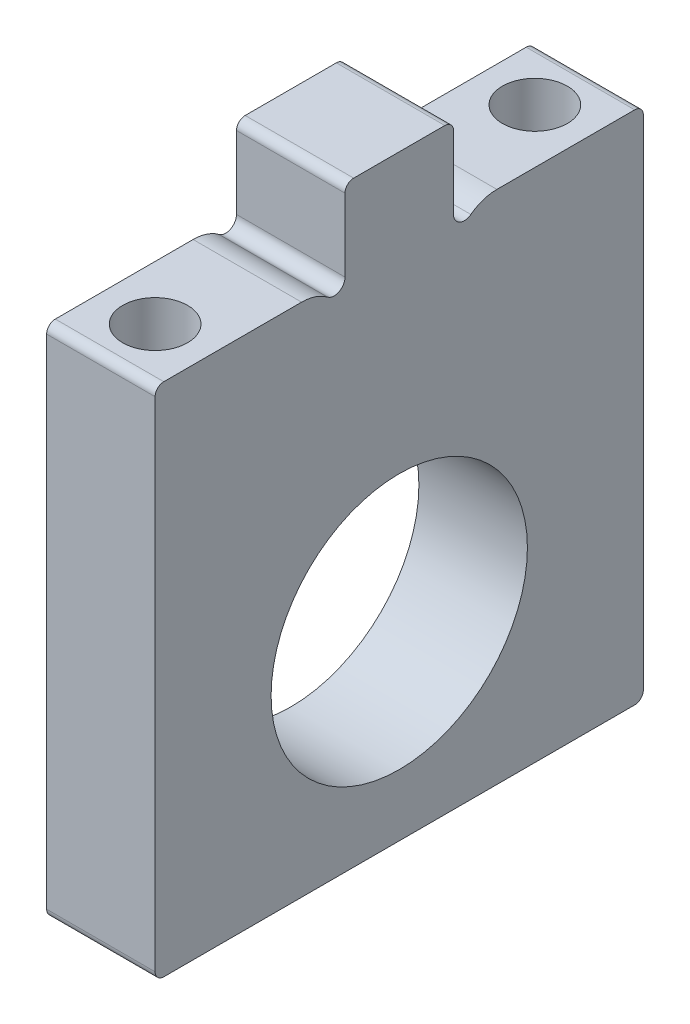
ISO-10303-21;
HEADER;
FILE_DESCRIPTION(('STEP AP214'),'2;1');
FILE_NAME('part.step','',(''),(''),'','','');
FILE_SCHEMA(('AUTOMOTIVE_DESIGN { 1 0 10303 214 1 1 1 1 }'));
ENDSEC;
DATA;
#1=APPLICATION_CONTEXT('core data for automotive mechanical design processes');
#2=APPLICATION_PROTOCOL_DEFINITION('international standard','automotive_design',2000,#1);
#3=PRODUCT_CONTEXT('',#1,'mechanical');
#4=PRODUCT('Part','Part','',(#3));
#5=PRODUCT_RELATED_PRODUCT_CATEGORY('part','',(#4));
#6=PRODUCT_DEFINITION_FORMATION('','',#4);
#7=PRODUCT_DEFINITION_CONTEXT('part definition',#1,'design');
#8=PRODUCT_DEFINITION('design','',#6,#7);
#9=PRODUCT_DEFINITION_SHAPE('','',#8);
#10=(LENGTH_UNIT() NAMED_UNIT(*) SI_UNIT(.MILLI.,.METRE.));
#11=(NAMED_UNIT(*) PLANE_ANGLE_UNIT() SI_UNIT($,.RADIAN.));
#12=(NAMED_UNIT(*) SI_UNIT($,.STERADIAN.) SOLID_ANGLE_UNIT());
#13=UNCERTAINTY_MEASURE_WITH_UNIT(LENGTH_MEASURE(1.E-05),#10,'distance_accuracy_value','');
#14=(GEOMETRIC_REPRESENTATION_CONTEXT(3) GLOBAL_UNCERTAINTY_ASSIGNED_CONTEXT((#13)) GLOBAL_UNIT_ASSIGNED_CONTEXT((#10,
#11,#12)) REPRESENTATION_CONTEXT('',''));
#15=CARTESIAN_POINT('',(0.,0.,0.));
#16=DIRECTION('',(0.,0.,1.));
#17=DIRECTION('',(1.,0.,0.));
#18=AXIS2_PLACEMENT_3D('',#15,#16,#17);
#19=CARTESIAN_POINT('',(0.,19.05,0.));
#20=DIRECTION('',(0.,-1.,0.));
#21=DIRECTION('',(0.,0.,-1.));
#22=AXIS2_PLACEMENT_3D('',#19,#20,#21);
#23=PLANE('',#22);
#24=CARTESIAN_POINT('',(30.1625,19.05,11.1125));
#25=DIRECTION('',(0.,1.,0.));
#26=DIRECTION('',(0.,0.,1.));
#27=AXIS2_PLACEMENT_3D('',#24,#25,#26);
#28=CIRCLE('',#27,1.89865);
#29=CARTESIAN_POINT('',(30.1625,19.05,13.01115));
#30=VERTEX_POINT('',#29);
#31=EDGE_CURVE('E312',#30,#30,#28,.F.);
#32=ORIENTED_EDGE('',*,*,#31,.T.);
#33=EDGE_LOOP('',(#32));
#34=FACE_BOUND('',#33,.T.);
#35=DIRECTION('',(0.,0.,-1.));
#36=VECTOR('',#35,1.);
#37=CARTESIAN_POINT('',(26.9875,19.05,-12.7));
#38=LINE('',#37,#36);
#39=CARTESIAN_POINT('',(26.9875,19.05,13.7795));
#40=VERTEX_POINT('',#39);
#41=CARTESIAN_POINT('',(26.9875,19.05,5.715));
#42=VERTEX_POINT('',#41);
#43=EDGE_CURVE('E214',#40,#42,#38,.T.);
#44=ORIENTED_EDGE('',*,*,#43,.F.);
#45=DIRECTION('',(1.,0.,0.));
#46=VECTOR('',#45,1.);
#47=CARTESIAN_POINT('',(33.3375,19.05,13.7795));
#48=LINE('',#47,#46);
#49=CARTESIAN_POINT('',(33.3375,19.05,13.7795));
#50=VERTEX_POINT('',#49);
#51=EDGE_CURVE('E42',#40,#50,#48,.T.);
#52=ORIENTED_EDGE('',*,*,#51,.T.);
#53=DIRECTION('',(0.,0.,1.));
#54=VECTOR('',#53,1.);
#55=CARTESIAN_POINT('',(33.3375,19.05,-12.7));
#56=LINE('',#55,#54);
#57=CARTESIAN_POINT('',(33.3375,19.05,5.715));
#58=VERTEX_POINT('',#57);
#59=EDGE_CURVE('E216',#58,#50,#56,.T.);
#60=ORIENTED_EDGE('',*,*,#59,.F.);
#61=DIRECTION('',(-1.,0.,0.));
#62=VECTOR('',#61,1.);
#63=CARTESIAN_POINT('',(0.,19.05,5.715));
#64=LINE('',#63,#62);
#65=EDGE_CURVE('E213',#58,#42,#64,.T.);
#66=ORIENTED_EDGE('',*,*,#65,.T.);
#67=EDGE_LOOP('',(#44,#52,#60,#66));
#68=FACE_BOUND('',#67,.T.);
#69=ADVANCED_FACE('F34',(#34,#68),#23,.F.);
#70=CARTESIAN_POINT('',(26.9875,-11.1125,-12.7));
#71=DIRECTION('',(1.,0.,0.));
#72=DIRECTION('',(0.,0.,-1.));
#73=AXIS2_PLACEMENT_3D('',#70,#71,#72);
#74=PLANE('',#73);
#75=CARTESIAN_POINT('',(26.9875,0.,0.));
#76=DIRECTION('',(1.,0.,0.));
#77=DIRECTION('',(0.,0.,-1.));
#78=AXIS2_PLACEMENT_3D('',#75,#76,#77);
#79=CIRCLE('',#78,7.5);
#80=CARTESIAN_POINT('',(26.9875,0.,-7.5));
#81=VERTEX_POINT('',#80);
#82=EDGE_CURVE('E188',#81,#81,#79,.F.);
#83=ORIENTED_EDGE('',*,*,#82,.F.);
#84=EDGE_LOOP('',(#83));
#85=FACE_BOUND('',#84,.T.);
#86=DIRECTION('',(0.,-1.,0.));
#87=VECTOR('',#86,1.);
#88=CARTESIAN_POINT('',(26.9875,19.05,-14.2875));
#89=LINE('',#88,#87);
#90=CARTESIAN_POINT('',(26.9875,18.542,-14.2875));
#91=VERTEX_POINT('',#90);
#92=CARTESIAN_POINT('',(26.9875,-10.6045,-14.2875));
#93=VERTEX_POINT('',#92);
#94=EDGE_CURVE('E321',#91,#93,#89,.T.);
#95=ORIENTED_EDGE('',*,*,#94,.T.);
#96=CARTESIAN_POINT('',(26.9875,-10.6045,-13.7795));
#97=DIRECTION('',(1.,0.,0.));
#98=DIRECTION('',(0.,0.,-1.));
#99=AXIS2_PLACEMENT_3D('',#96,#97,#98);
#100=CIRCLE('',#99,0.508);
#101=CARTESIAN_POINT('',(26.9875,-11.1125,-13.7795));
#102=VERTEX_POINT('',#101);
#103=EDGE_CURVE('E265',#93,#102,#100,.F.);
#104=ORIENTED_EDGE('',*,*,#103,.T.);
#105=DIRECTION('',(0.,0.,-1.));
#106=VECTOR('',#105,1.);
#107=CARTESIAN_POINT('',(26.9875,-11.1125,-12.7));
#108=LINE('',#107,#106);
#109=CARTESIAN_POINT('',(26.9875,-11.1125,13.7795));
#110=VERTEX_POINT('',#109);
#111=EDGE_CURVE('E206',#110,#102,#108,.T.);
#112=ORIENTED_EDGE('',*,*,#111,.F.);
#113=CARTESIAN_POINT('',(26.9875,-10.6045,13.7795));
#114=DIRECTION('',(1.,0.,0.));
#115=DIRECTION('',(0.,0.,-1.));
#116=AXIS2_PLACEMENT_3D('',#113,#114,#115);
#117=CIRCLE('',#116,0.508);
#118=CARTESIAN_POINT('',(26.9875,-10.6045,14.2875));
#119=VERTEX_POINT('',#118);
#120=EDGE_CURVE('E56',#110,#119,#117,.F.);
#121=ORIENTED_EDGE('',*,*,#120,.T.);
#122=DIRECTION('',(0.,1.,0.));
#123=VECTOR('',#122,1.);
#124=CARTESIAN_POINT('',(26.9875,19.05,14.2875));
#125=LINE('',#124,#123);
#126=CARTESIAN_POINT('',(26.9875,18.542,14.2875));
#127=VERTEX_POINT('',#126);
#128=EDGE_CURVE('E326',#119,#127,#125,.T.);
#129=ORIENTED_EDGE('',*,*,#128,.T.);
#130=CARTESIAN_POINT('',(26.9875,18.542,13.7795));
#131=DIRECTION('',(1.,0.,0.));
#132=DIRECTION('',(0.,0.,-1.));
#133=AXIS2_PLACEMENT_3D('',#130,#131,#132);
#134=CIRCLE('',#133,0.508);
#135=EDGE_CURVE('E258',#127,#40,#134,.F.);
#136=ORIENTED_EDGE('',*,*,#135,.T.);
#137=ORIENTED_EDGE('',*,*,#43,.T.);
#138=CARTESIAN_POINT('',(26.9875,16.51,5.715));
#139=DIRECTION('',(1.,0.,0.));
#140=DIRECTION('',(0.,0.,-1.));
#141=AXIS2_PLACEMENT_3D('',#138,#139,#140);
#142=CIRCLE('',#141,2.54);
#143=CARTESIAN_POINT('',(26.9875,18.542,4.191));
#144=VERTEX_POINT('',#143);
#145=EDGE_CURVE('E222',#42,#144,#142,.F.);
#146=ORIENTED_EDGE('',*,*,#145,.T.);
#147=CARTESIAN_POINT('',(26.9875,19.05,3.81));
#148=DIRECTION('',(-1.,0.,0.));
#149=DIRECTION('',(0.,0.,1.));
#150=AXIS2_PLACEMENT_3D('',#147,#148,#149);
#151=CIRCLE('',#150,0.635);
#152=CARTESIAN_POINT('',(26.9875,19.05,3.175));
#153=VERTEX_POINT('',#152);
#154=EDGE_CURVE('E301',#153,#144,#151,.T.);
#155=ORIENTED_EDGE('',*,*,#154,.F.);
#156=DIRECTION('',(0.,1.,0.));
#157=VECTOR('',#156,1.);
#158=CARTESIAN_POINT('',(26.9875,23.8125,3.175));
#159=LINE('',#158,#157);
#160=CARTESIAN_POINT('',(26.9875,23.3045,3.175));
#161=VERTEX_POINT('',#160);
#162=EDGE_CURVE('E196',#153,#161,#159,.T.);
#163=ORIENTED_EDGE('',*,*,#162,.T.);
#164=CARTESIAN_POINT('',(26.9875,23.3045,2.667));
#165=DIRECTION('',(1.,0.,0.));
#166=DIRECTION('',(0.,0.,-1.));
#167=AXIS2_PLACEMENT_3D('',#164,#165,#166);
#168=CIRCLE('',#167,0.508);
#169=CARTESIAN_POINT('',(26.9875,23.8125,2.667));
#170=VERTEX_POINT('',#169);
#171=EDGE_CURVE('E260',#161,#170,#168,.F.);
#172=ORIENTED_EDGE('',*,*,#171,.T.);
#173=DIRECTION('',(0.,0.,-1.));
#174=VECTOR('',#173,1.);
#175=CARTESIAN_POINT('',(26.9875,23.8125,-3.175));
#176=LINE('',#175,#174);
#177=CARTESIAN_POINT('',(26.9875,23.8125,-2.667));
#178=VERTEX_POINT('',#177);
#179=EDGE_CURVE('E201',#170,#178,#176,.T.);
#180=ORIENTED_EDGE('',*,*,#179,.T.);
#181=CARTESIAN_POINT('',(26.9875,23.3045,-2.667));
#182=DIRECTION('',(1.,0.,0.));
#183=DIRECTION('',(0.,0.,-1.));
#184=AXIS2_PLACEMENT_3D('',#181,#182,#183);
#185=CIRCLE('',#184,0.508);
#186=CARTESIAN_POINT('',(26.9875,23.3045,-3.175));
#187=VERTEX_POINT('',#186);
#188=EDGE_CURVE('E262',#178,#187,#185,.F.);
#189=ORIENTED_EDGE('',*,*,#188,.T.);
#190=DIRECTION('',(0.,-1.,0.));
#191=VECTOR('',#190,1.);
#192=CARTESIAN_POINT('',(26.9875,19.05,-3.175));
#193=LINE('',#192,#191);
#194=CARTESIAN_POINT('',(26.9875,19.05,-3.175));
#195=VERTEX_POINT('',#194);
#196=EDGE_CURVE('E203',#187,#195,#193,.T.);
#197=ORIENTED_EDGE('',*,*,#196,.T.);
#198=CARTESIAN_POINT('',(26.9875,19.05,-3.81));
#199=DIRECTION('',(-1.,0.,0.));
#200=DIRECTION('',(0.,0.,1.));
#201=AXIS2_PLACEMENT_3D('',#198,#199,#200);
#202=CIRCLE('',#201,0.635);
#203=CARTESIAN_POINT('',(26.9875,18.542,-4.191));
#204=VERTEX_POINT('',#203);
#205=EDGE_CURVE('E171',#204,#195,#202,.T.);
#206=ORIENTED_EDGE('',*,*,#205,.F.);
#207=CARTESIAN_POINT('',(26.9875,16.51,-5.715));
#208=DIRECTION('',(1.,0.,0.));
#209=DIRECTION('',(0.,0.,-1.));
#210=AXIS2_PLACEMENT_3D('',#207,#208,#209);
#211=CIRCLE('',#210,2.54);
#212=CARTESIAN_POINT('',(26.9875,19.05,-5.715));
#213=VERTEX_POINT('',#212);
#214=EDGE_CURVE('E220',#204,#213,#211,.F.);
#215=ORIENTED_EDGE('',*,*,#214,.T.);
#216=CARTESIAN_POINT('',(26.9875,19.05,-13.7795));
#217=VERTEX_POINT('',#216);
#218=EDGE_CURVE('E205',#213,#217,#38,.T.);
#219=ORIENTED_EDGE('',*,*,#218,.T.);
#220=CARTESIAN_POINT('',(26.9875,18.542,-13.7795));
#221=DIRECTION('',(1.,0.,0.));
#222=DIRECTION('',(0.,0.,-1.));
#223=AXIS2_PLACEMENT_3D('',#220,#221,#222);
#224=CIRCLE('',#223,0.508);
#225=EDGE_CURVE('E256',#217,#91,#224,.F.);
#226=ORIENTED_EDGE('',*,*,#225,.T.);
#227=EDGE_LOOP('',(#95,#104,#112,#121,#129,#136,#137,#146,#155,#163,#172,#180,#189,#197,#206,
#215,#219,#226));
#228=FACE_BOUND('',#227,.T.);
#229=ADVANCED_FACE('F299',(#85,#228),#74,.F.);
#230=CARTESIAN_POINT('',(33.3375,-11.1125,-12.7));
#231=DIRECTION('',(-1.,0.,0.));
#232=DIRECTION('',(0.,0.,1.));
#233=AXIS2_PLACEMENT_3D('',#230,#231,#232);
#234=PLANE('',#233);
#235=CARTESIAN_POINT('',(33.3375,0.,0.));
#236=DIRECTION('',(1.,0.,0.));
#237=DIRECTION('',(0.,0.,-1.));
#238=AXIS2_PLACEMENT_3D('',#235,#236,#237);
#239=CIRCLE('',#238,7.5);
#240=CARTESIAN_POINT('',(33.3375,0.,-7.5));
#241=VERTEX_POINT('',#240);
#242=EDGE_CURVE('E193',#241,#241,#239,.T.);
#243=ORIENTED_EDGE('',*,*,#242,.F.);
#244=EDGE_LOOP('',(#243));
#245=FACE_BOUND('',#244,.T.);
#246=DIRECTION('',(0.,0.,1.));
#247=VECTOR('',#246,1.);
#248=CARTESIAN_POINT('',(33.3375,-11.1125,-12.7));
#249=LINE('',#248,#247);
#250=CARTESIAN_POINT('',(33.3375,-11.1125,-13.7795));
#251=VERTEX_POINT('',#250);
#252=CARTESIAN_POINT('',(33.3375,-11.1125,13.7795));
#253=VERTEX_POINT('',#252);
#254=EDGE_CURVE('E209',#251,#253,#249,.T.);
#255=ORIENTED_EDGE('',*,*,#254,.F.);
#256=CARTESIAN_POINT('',(33.3375,-10.6045,-13.7795));
#257=DIRECTION('',(-1.,0.,0.));
#258=DIRECTION('',(0.,0.,1.));
#259=AXIS2_PLACEMENT_3D('',#256,#257,#258);
#260=CIRCLE('',#259,0.508);
#261=CARTESIAN_POINT('',(33.3375,-10.6045,-14.2875));
#262=VERTEX_POINT('',#261);
#263=EDGE_CURVE('E249',#251,#262,#260,.F.);
#264=ORIENTED_EDGE('',*,*,#263,.T.);
#265=DIRECTION('',(0.,1.,0.));
#266=VECTOR('',#265,1.);
#267=CARTESIAN_POINT('',(33.3375,19.05,-14.2875));
#268=LINE('',#267,#266);
#269=CARTESIAN_POINT('',(33.3375,18.542,-14.2875));
#270=VERTEX_POINT('',#269);
#271=EDGE_CURVE('E316',#262,#270,#268,.T.);
#272=ORIENTED_EDGE('',*,*,#271,.T.);
#273=CARTESIAN_POINT('',(33.3375,18.542,-13.7795));
#274=DIRECTION('',(-1.,0.,0.));
#275=DIRECTION('',(0.,0.,1.));
#276=AXIS2_PLACEMENT_3D('',#273,#274,#275);
#277=CIRCLE('',#276,0.508);
#278=CARTESIAN_POINT('',(33.3375,19.05,-13.7795));
#279=VERTEX_POINT('',#278);
#280=EDGE_CURVE('E239',#270,#279,#277,.F.);
#281=ORIENTED_EDGE('',*,*,#280,.T.);
#282=CARTESIAN_POINT('',(33.3375,19.05,-5.715));
#283=VERTEX_POINT('',#282);
#284=EDGE_CURVE('E210',#279,#283,#56,.T.);
#285=ORIENTED_EDGE('',*,*,#284,.T.);
#286=CARTESIAN_POINT('',(33.3375,16.51,-5.715));
#287=DIRECTION('',(-1.,0.,0.));
#288=DIRECTION('',(0.,0.,1.));
#289=AXIS2_PLACEMENT_3D('',#286,#287,#288);
#290=CIRCLE('',#289,2.54);
#291=CARTESIAN_POINT('',(33.3375,18.542,-4.191));
#292=VERTEX_POINT('',#291);
#293=EDGE_CURVE('E167',#283,#292,#290,.F.);
#294=ORIENTED_EDGE('',*,*,#293,.T.);
#295=CARTESIAN_POINT('',(33.3375,19.05,-3.81));
#296=DIRECTION('',(-1.,0.,0.));
#297=DIRECTION('',(0.,0.,1.));
#298=AXIS2_PLACEMENT_3D('',#295,#296,#297);
#299=CIRCLE('',#298,0.635);
#300=CARTESIAN_POINT('',(33.3375,19.05,-3.175));
#301=VERTEX_POINT('',#300);
#302=EDGE_CURVE('E160',#292,#301,#299,.T.);
#303=ORIENTED_EDGE('',*,*,#302,.T.);
#304=DIRECTION('',(0.,1.,0.));
#305=VECTOR('',#304,1.);
#306=CARTESIAN_POINT('',(33.3375,19.05,-3.175));
#307=LINE('',#306,#305);
#308=CARTESIAN_POINT('',(33.3375,23.3045,-3.175));
#309=VERTEX_POINT('',#308);
#310=EDGE_CURVE('E165',#301,#309,#307,.T.);
#311=ORIENTED_EDGE('',*,*,#310,.T.);
#312=CARTESIAN_POINT('',(33.3375,23.3045,-2.667));
#313=DIRECTION('',(-1.,0.,0.));
#314=DIRECTION('',(0.,0.,1.));
#315=AXIS2_PLACEMENT_3D('',#312,#313,#314);
#316=CIRCLE('',#315,0.508);
#317=CARTESIAN_POINT('',(33.3375,23.8125,-2.667));
#318=VERTEX_POINT('',#317);
#319=EDGE_CURVE('E245',#309,#318,#316,.F.);
#320=ORIENTED_EDGE('',*,*,#319,.T.);
#321=DIRECTION('',(0.,0.,1.));
#322=VECTOR('',#321,1.);
#323=CARTESIAN_POINT('',(33.3375,23.8125,-3.175));
#324=LINE('',#323,#322);
#325=CARTESIAN_POINT('',(33.3375,23.8125,2.667));
#326=VERTEX_POINT('',#325);
#327=EDGE_CURVE('E187',#318,#326,#324,.T.);
#328=ORIENTED_EDGE('',*,*,#327,.T.);
#329=CARTESIAN_POINT('',(33.3375,23.3045,2.667));
#330=DIRECTION('',(-1.,0.,0.));
#331=DIRECTION('',(0.,0.,1.));
#332=AXIS2_PLACEMENT_3D('',#329,#330,#331);
#333=CIRCLE('',#332,0.508);
#334=CARTESIAN_POINT('',(33.3375,23.3045,3.175));
#335=VERTEX_POINT('',#334);
#336=EDGE_CURVE('E243',#326,#335,#333,.F.);
#337=ORIENTED_EDGE('',*,*,#336,.T.);
#338=DIRECTION('',(0.,-1.,0.));
#339=VECTOR('',#338,1.);
#340=CARTESIAN_POINT('',(33.3375,23.8125,3.175));
#341=LINE('',#340,#339);
#342=CARTESIAN_POINT('',(33.3375,19.05,3.175));
#343=VERTEX_POINT('',#342);
#344=EDGE_CURVE('E181',#335,#343,#341,.T.);
#345=ORIENTED_EDGE('',*,*,#344,.T.);
#346=CARTESIAN_POINT('',(33.3375,19.05,3.81));
#347=DIRECTION('',(-1.,0.,0.));
#348=DIRECTION('',(0.,0.,1.));
#349=AXIS2_PLACEMENT_3D('',#346,#347,#348);
#350=CIRCLE('',#349,0.635);
#351=CARTESIAN_POINT('',(33.3375,18.542,4.191));
#352=VERTEX_POINT('',#351);
#353=EDGE_CURVE('E291',#343,#352,#350,.T.);
#354=ORIENTED_EDGE('',*,*,#353,.T.);
#355=CARTESIAN_POINT('',(33.3375,16.51,5.715));
#356=DIRECTION('',(-1.,0.,0.));
#357=DIRECTION('',(0.,0.,1.));
#358=AXIS2_PLACEMENT_3D('',#355,#356,#357);
#359=CIRCLE('',#358,2.54);
#360=EDGE_CURVE('E227',#352,#58,#359,.F.);
#361=ORIENTED_EDGE('',*,*,#360,.T.);
#362=ORIENTED_EDGE('',*,*,#59,.T.);
#363=CARTESIAN_POINT('',(33.3375,18.542,13.7795));
#364=DIRECTION('',(-1.,0.,0.));
#365=DIRECTION('',(0.,0.,1.));
#366=AXIS2_PLACEMENT_3D('',#363,#364,#365);
#367=CIRCLE('',#366,0.508);
#368=CARTESIAN_POINT('',(33.3375,18.542,14.2875));
#369=VERTEX_POINT('',#368);
#370=EDGE_CURVE('E241',#50,#369,#367,.F.);
#371=ORIENTED_EDGE('',*,*,#370,.T.);
#372=DIRECTION('',(0.,-1.,0.));
#373=VECTOR('',#372,1.);
#374=CARTESIAN_POINT('',(33.3375,19.05,14.2875));
#375=LINE('',#374,#373);
#376=CARTESIAN_POINT('',(33.3375,-10.6045,14.2875));
#377=VERTEX_POINT('',#376);
#378=EDGE_CURVE('E323',#369,#377,#375,.T.);
#379=ORIENTED_EDGE('',*,*,#378,.T.);
#380=CARTESIAN_POINT('',(33.3375,-10.6045,13.7795));
#381=DIRECTION('',(-1.,0.,0.));
#382=DIRECTION('',(0.,0.,1.));
#383=AXIS2_PLACEMENT_3D('',#380,#381,#382);
#384=CIRCLE('',#383,0.508);
#385=EDGE_CURVE('E247',#377,#253,#384,.F.);
#386=ORIENTED_EDGE('',*,*,#385,.T.);
#387=EDGE_LOOP('',(#255,#264,#272,#281,#285,#294,#303,#311,#320,#328,#337,#345,#354,#361,#362,
#371,#379,#386));
#388=FACE_BOUND('',#387,.T.);
#389=ADVANCED_FACE('F163',(#245,#388),#234,.F.);
#390=CARTESIAN_POINT('',(0.,-11.1125,0.));
#391=DIRECTION('',(0.,-1.,0.));
#392=DIRECTION('',(0.,0.,-1.));
#393=AXIS2_PLACEMENT_3D('',#390,#391,#392);
#394=PLANE('',#393);
#395=CARTESIAN_POINT('',(30.1625,-11.1125,11.1125));
#396=DIRECTION('',(0.,-1.,0.));
#397=DIRECTION('',(0.,0.,-1.));
#398=AXIS2_PLACEMENT_3D('',#395,#396,#397);
#399=CIRCLE('',#398,1.89865);
#400=CARTESIAN_POINT('',(30.1625,-11.1125,9.21385));
#401=VERTEX_POINT('',#400);
#402=EDGE_CURVE('E309',#401,#401,#399,.T.);
#403=ORIENTED_EDGE('',*,*,#402,.F.);
#404=EDGE_LOOP('',(#403));
#405=FACE_BOUND('',#404,.T.);
#406=CARTESIAN_POINT('',(30.1625,-11.1125,-11.1125));
#407=DIRECTION('',(0.,-1.,0.));
#408=DIRECTION('',(0.,0.,-1.));
#409=AXIS2_PLACEMENT_3D('',#406,#407,#408);
#410=CIRCLE('',#409,1.89865);
#411=CARTESIAN_POINT('',(30.1625,-11.1125,-13.01115));
#412=VERTEX_POINT('',#411);
#413=EDGE_CURVE('E170',#412,#412,#410,.T.);
#414=ORIENTED_EDGE('',*,*,#413,.F.);
#415=EDGE_LOOP('',(#414));
#416=FACE_BOUND('',#415,.T.);
#417=ORIENTED_EDGE('',*,*,#111,.T.);
#418=DIRECTION('',(1.,0.,0.));
#419=VECTOR('',#418,1.);
#420=CARTESIAN_POINT('',(0.,-11.1125,-13.7795));
#421=LINE('',#420,#419);
#422=EDGE_CURVE('E236',#102,#251,#421,.T.);
#423=ORIENTED_EDGE('',*,*,#422,.T.);
#424=ORIENTED_EDGE('',*,*,#254,.T.);
#425=DIRECTION('',(1.,0.,0.));
#426=VECTOR('',#425,1.);
#427=CARTESIAN_POINT('',(0.,-11.1125,13.7795));
#428=LINE('',#427,#426);
#429=EDGE_CURVE('E234',#253,#110,#428,.F.);
#430=ORIENTED_EDGE('',*,*,#429,.T.);
#431=EDGE_LOOP('',(#417,#423,#424,#430));
#432=FACE_BOUND('',#431,.T.);
#433=ADVANCED_FACE('F369',(#405,#416,#432),#394,.T.);
#434=CARTESIAN_POINT('',(30.1625,19.05,-11.1125));
#435=DIRECTION('',(0.,1.,0.));
#436=DIRECTION('',(0.,0.,1.));
#437=AXIS2_PLACEMENT_3D('',#434,#435,#436);
#438=CIRCLE('',#437,1.89865);
#439=CARTESIAN_POINT('',(30.1625,19.05,-9.21385));
#440=VERTEX_POINT('',#439);
#441=EDGE_CURVE('E313',#440,#440,#438,.F.);
#442=ORIENTED_EDGE('',*,*,#441,.T.);
#443=EDGE_LOOP('',(#442));
#444=FACE_BOUND('',#443,.T.);
#445=ORIENTED_EDGE('',*,*,#284,.F.);
#446=DIRECTION('',(1.,0.,0.));
#447=VECTOR('',#446,1.);
#448=CARTESIAN_POINT('',(26.9875,19.05,-13.7795));
#449=LINE('',#448,#447);
#450=EDGE_CURVE('E11',#279,#217,#449,.F.);
#451=ORIENTED_EDGE('',*,*,#450,.T.);
#452=ORIENTED_EDGE('',*,*,#218,.F.);
#453=DIRECTION('',(-1.,0.,0.));
#454=VECTOR('',#453,1.);
#455=CARTESIAN_POINT('',(0.,19.05,-5.715));
#456=LINE('',#455,#454);
#457=EDGE_CURVE('E229',#213,#283,#456,.F.);
#458=ORIENTED_EDGE('',*,*,#457,.T.);
#459=EDGE_LOOP('',(#445,#451,#452,#458));
#460=FACE_BOUND('',#459,.T.);
#461=ADVANCED_FACE('F354',(#444,#460),#23,.F.);
#462=CARTESIAN_POINT('',(19.05,23.8125,3.175));
#463=DIRECTION('',(0.,0.,1.));
#464=DIRECTION('',(1.,0.,0.));
#465=AXIS2_PLACEMENT_3D('',#462,#463,#464);
#466=PLANE('',#465);
#467=ORIENTED_EDGE('',*,*,#344,.F.);
#468=DIRECTION('',(1.,0.,0.));
#469=VECTOR('',#468,1.);
#470=CARTESIAN_POINT('',(19.05,23.3045,3.175));
#471=LINE('',#470,#469);
#472=EDGE_CURVE('E277',#335,#161,#471,.F.);
#473=ORIENTED_EDGE('',*,*,#472,.T.);
#474=ORIENTED_EDGE('',*,*,#162,.F.);
#475=DIRECTION('',(1.,0.,0.));
#476=VECTOR('',#475,1.);
#477=CARTESIAN_POINT('',(19.05,19.05,3.175));
#478=LINE('',#477,#476);
#479=EDGE_CURVE('E180',#153,#343,#478,.T.);
#480=ORIENTED_EDGE('',*,*,#479,.T.);
#481=EDGE_LOOP('',(#467,#473,#474,#480));
#482=FACE_BOUND('',#481,.T.);
#483=ADVANCED_FACE('F393',(#482),#466,.T.);
#484=CARTESIAN_POINT('',(19.05,23.8125,-3.175));
#485=DIRECTION('',(0.,1.,0.));
#486=DIRECTION('',(0.,0.,1.));
#487=AXIS2_PLACEMENT_3D('',#484,#485,#486);
#488=PLANE('',#487);
#489=ORIENTED_EDGE('',*,*,#327,.F.);
#490=DIRECTION('',(1.,0.,0.));
#491=VECTOR('',#490,1.);
#492=CARTESIAN_POINT('',(19.05,23.8125,-2.667));
#493=LINE('',#492,#491);
#494=EDGE_CURVE('E275',#318,#178,#493,.F.);
#495=ORIENTED_EDGE('',*,*,#494,.T.);
#496=ORIENTED_EDGE('',*,*,#179,.F.);
#497=DIRECTION('',(1.,0.,0.));
#498=VECTOR('',#497,1.);
#499=CARTESIAN_POINT('',(19.05,23.8125,2.667));
#500=LINE('',#499,#498);
#501=EDGE_CURVE('E272',#170,#326,#500,.T.);
#502=ORIENTED_EDGE('',*,*,#501,.T.);
#503=EDGE_LOOP('',(#489,#495,#496,#502));
#504=FACE_BOUND('',#503,.T.);
#505=ADVANCED_FACE('F341',(#504),#488,.T.);
#506=CARTESIAN_POINT('',(19.05,19.05,-3.175));
#507=DIRECTION('',(0.,0.,-1.));
#508=DIRECTION('',(-1.,0.,0.));
#509=AXIS2_PLACEMENT_3D('',#506,#507,#508);
#510=PLANE('',#509);
#511=ORIENTED_EDGE('',*,*,#196,.F.);
#512=DIRECTION('',(1.,0.,0.));
#513=VECTOR('',#512,1.);
#514=CARTESIAN_POINT('',(19.05,23.3045,-3.175));
#515=LINE('',#514,#513);
#516=EDGE_CURVE('E186',#187,#309,#515,.T.);
#517=ORIENTED_EDGE('',*,*,#516,.T.);
#518=ORIENTED_EDGE('',*,*,#310,.F.);
#519=DIRECTION('',(1.,0.,0.));
#520=VECTOR('',#519,1.);
#521=CARTESIAN_POINT('',(19.05,19.05,-3.175));
#522=LINE('',#521,#520);
#523=EDGE_CURVE('E175',#195,#301,#522,.T.);
#524=ORIENTED_EDGE('',*,*,#523,.F.);
#525=EDGE_LOOP('',(#511,#517,#518,#524));
#526=FACE_BOUND('',#525,.T.);
#527=ADVANCED_FACE('F184',(#526),#510,.T.);
#528=CARTESIAN_POINT('',(-34.781382401578,0.,0.));
#529=DIRECTION('',(1.,0.,0.));
#530=DIRECTION('',(0.,0.,-1.));
#531=AXIS2_PLACEMENT_3D('',#528,#529,#530);
#532=CYLINDRICAL_SURFACE('',#531,7.5);
#533=ORIENTED_EDGE('',*,*,#242,.T.);
#534=EDGE_LOOP('',(#533));
#535=FACE_BOUND('',#534,.T.);
#536=ORIENTED_EDGE('',*,*,#82,.T.);
#537=EDGE_LOOP('',(#536));
#538=FACE_BOUND('',#537,.T.);
#539=ADVANCED_FACE('F419',(#535,#538),#532,.F.);
#540=CARTESIAN_POINT('',(-3.21674742482421,19.05,14.2875));
#541=DIRECTION('',(0.,0.,1.));
#542=DIRECTION('',(0.,-1.,0.));
#543=AXIS2_PLACEMENT_3D('',#540,#541,#542);
#544=PLANE('',#543);
#545=ORIENTED_EDGE('',*,*,#128,.F.);
#546=DIRECTION('',(1.,0.,0.));
#547=VECTOR('',#546,1.);
#548=CARTESIAN_POINT('',(-3.21674742482421,-10.6045,14.2875));
#549=LINE('',#548,#547);
#550=EDGE_CURVE('E268',#119,#377,#549,.T.);
#551=ORIENTED_EDGE('',*,*,#550,.T.);
#552=ORIENTED_EDGE('',*,*,#378,.F.);
#553=DIRECTION('',(1.,0.,0.));
#554=VECTOR('',#553,1.);
#555=CARTESIAN_POINT('',(26.9875,18.542,14.2875));
#556=LINE('',#555,#554);
#557=EDGE_CURVE('E49',#369,#127,#556,.F.);
#558=ORIENTED_EDGE('',*,*,#557,.T.);
#559=EDGE_LOOP('',(#545,#551,#552,#558));
#560=FACE_BOUND('',#559,.T.);
#561=ADVANCED_FACE('F374',(#560),#544,.T.);
#562=CARTESIAN_POINT('',(-3.21674742482421,19.05,-14.2875));
#563=DIRECTION('',(0.,0.,-1.));
#564=DIRECTION('',(-1.,0.,0.));
#565=AXIS2_PLACEMENT_3D('',#562,#563,#564);
#566=PLANE('',#565);
#567=ORIENTED_EDGE('',*,*,#271,.F.);
#568=DIRECTION('',(1.,0.,0.));
#569=VECTOR('',#568,1.);
#570=CARTESIAN_POINT('',(-3.21674742482421,-10.6045,-14.2875));
#571=LINE('',#570,#569);
#572=EDGE_CURVE('E254',#262,#93,#571,.F.);
#573=ORIENTED_EDGE('',*,*,#572,.T.);
#574=ORIENTED_EDGE('',*,*,#94,.F.);
#575=DIRECTION('',(1.,0.,0.));
#576=VECTOR('',#575,1.);
#577=CARTESIAN_POINT('',(33.3375,18.542,-14.2875));
#578=LINE('',#577,#576);
#579=EDGE_CURVE('E251',#91,#270,#578,.T.);
#580=ORIENTED_EDGE('',*,*,#579,.T.);
#581=EDGE_LOOP('',(#567,#573,#574,#580));
#582=FACE_BOUND('',#581,.T.);
#583=ADVANCED_FACE('F362',(#582),#566,.T.);
#584=CARTESIAN_POINT('',(30.1625,24.4201931603994,-11.1125));
#585=DIRECTION('',(0.,-1.,0.));
#586=DIRECTION('',(0.,0.,-1.));
#587=AXIS2_PLACEMENT_3D('',#584,#585,#586);
#588=CYLINDRICAL_SURFACE('',#587,1.89865);
#589=ORIENTED_EDGE('',*,*,#413,.T.);
#590=EDGE_LOOP('',(#589));
#591=FACE_BOUND('',#590,.T.);
#592=ORIENTED_EDGE('',*,*,#441,.F.);
#593=EDGE_LOOP('',(#592));
#594=FACE_BOUND('',#593,.T.);
#595=ADVANCED_FACE('F403',(#591,#594),#588,.F.);
#596=CARTESIAN_POINT('',(30.1625,24.4201931603994,11.1125));
#597=DIRECTION('',(0.,-1.,0.));
#598=DIRECTION('',(0.,0.,-1.));
#599=AXIS2_PLACEMENT_3D('',#596,#597,#598);
#600=CYLINDRICAL_SURFACE('',#599,1.89865);
#601=ORIENTED_EDGE('',*,*,#402,.T.);
#602=EDGE_LOOP('',(#601));
#603=FACE_BOUND('',#602,.T.);
#604=ORIENTED_EDGE('',*,*,#31,.F.);
#605=EDGE_LOOP('',(#604));
#606=FACE_BOUND('',#605,.T.);
#607=ADVANCED_FACE('F405',(#603,#606),#600,.F.);
#608=CARTESIAN_POINT('',(33.3375,19.05,-3.81));
#609=DIRECTION('',(-1.,0.,0.));
#610=DIRECTION('',(0.,0.,1.));
#611=AXIS2_PLACEMENT_3D('',#608,#609,#610);
#612=CYLINDRICAL_SURFACE('',#611,0.635);
#613=ORIENTED_EDGE('',*,*,#302,.F.);
#614=DIRECTION('',(-1.,0.,0.));
#615=VECTOR('',#614,1.);
#616=CARTESIAN_POINT('',(33.3375,18.542,-4.191));
#617=LINE('',#616,#615);
#618=EDGE_CURVE('E232',#292,#204,#617,.T.);
#619=ORIENTED_EDGE('',*,*,#618,.T.);
#620=ORIENTED_EDGE('',*,*,#205,.T.);
#621=ORIENTED_EDGE('',*,*,#523,.T.);
#622=EDGE_LOOP('',(#613,#619,#620,#621));
#623=FACE_BOUND('',#622,.T.);
#624=ADVANCED_FACE('F176',(#623),#612,.F.);
#625=CARTESIAN_POINT('',(33.3375,19.05,3.81));
#626=DIRECTION('',(-1.,0.,0.));
#627=DIRECTION('',(0.,0.,1.));
#628=AXIS2_PLACEMENT_3D('',#625,#626,#627);
#629=CYLINDRICAL_SURFACE('',#628,0.635);
#630=ORIENTED_EDGE('',*,*,#154,.T.);
#631=DIRECTION('',(-1.,0.,0.));
#632=VECTOR('',#631,1.);
#633=CARTESIAN_POINT('',(33.3375,18.542,4.191));
#634=LINE('',#633,#632);
#635=EDGE_CURVE('E224',#144,#352,#634,.F.);
#636=ORIENTED_EDGE('',*,*,#635,.T.);
#637=ORIENTED_EDGE('',*,*,#353,.F.);
#638=ORIENTED_EDGE('',*,*,#479,.F.);
#639=EDGE_LOOP('',(#630,#636,#637,#638));
#640=FACE_BOUND('',#639,.T.);
#641=ADVANCED_FACE('F304',(#640),#629,.F.);
#642=CARTESIAN_POINT('',(33.3375,16.51,5.715));
#643=DIRECTION('',(-1.,0.,0.));
#644=DIRECTION('',(0.,0.,1.));
#645=AXIS2_PLACEMENT_3D('',#642,#643,#644);
#646=CYLINDRICAL_SURFACE('',#645,2.54);
#647=ORIENTED_EDGE('',*,*,#360,.F.);
#648=ORIENTED_EDGE('',*,*,#635,.F.);
#649=ORIENTED_EDGE('',*,*,#145,.F.);
#650=ORIENTED_EDGE('',*,*,#65,.F.);
#651=EDGE_LOOP('',(#647,#648,#649,#650));
#652=FACE_BOUND('',#651,.T.);
#653=ADVANCED_FACE('F294',(#652),#646,.T.);
#654=CARTESIAN_POINT('',(33.3375,16.51,-5.715));
#655=DIRECTION('',(-1.,0.,0.));
#656=DIRECTION('',(0.,0.,1.));
#657=AXIS2_PLACEMENT_3D('',#654,#655,#656);
#658=CYLINDRICAL_SURFACE('',#657,2.54);
#659=ORIENTED_EDGE('',*,*,#214,.F.);
#660=ORIENTED_EDGE('',*,*,#618,.F.);
#661=ORIENTED_EDGE('',*,*,#293,.F.);
#662=ORIENTED_EDGE('',*,*,#457,.F.);
#663=EDGE_LOOP('',(#659,#660,#661,#662));
#664=FACE_BOUND('',#663,.T.);
#665=ADVANCED_FACE('F351',(#664),#658,.T.);
#666=CARTESIAN_POINT('',(0.,-10.6045,-13.7795));
#667=DIRECTION('',(1.,0.,0.));
#668=DIRECTION('',(0.,0.,-1.));
#669=AXIS2_PLACEMENT_3D('',#666,#667,#668);
#670=CYLINDRICAL_SURFACE('',#669,0.508);
#671=ORIENTED_EDGE('',*,*,#103,.F.);
#672=ORIENTED_EDGE('',*,*,#572,.F.);
#673=ORIENTED_EDGE('',*,*,#263,.F.);
#674=ORIENTED_EDGE('',*,*,#422,.F.);
#675=EDGE_LOOP('',(#671,#672,#673,#674));
#676=FACE_BOUND('',#675,.T.);
#677=ADVANCED_FACE('F367',(#676),#670,.T.);
#678=CARTESIAN_POINT('',(-3.21674742482421,-10.6045,13.7795));
#679=DIRECTION('',(1.,0.,0.));
#680=DIRECTION('',(0.,0.,-1.));
#681=AXIS2_PLACEMENT_3D('',#678,#679,#680);
#682=CYLINDRICAL_SURFACE('',#681,0.508);
#683=ORIENTED_EDGE('',*,*,#120,.F.);
#684=ORIENTED_EDGE('',*,*,#429,.F.);
#685=ORIENTED_EDGE('',*,*,#385,.F.);
#686=ORIENTED_EDGE('',*,*,#550,.F.);
#687=EDGE_LOOP('',(#683,#684,#685,#686));
#688=FACE_BOUND('',#687,.T.);
#689=ADVANCED_FACE('F373',(#688),#682,.T.);
#690=CARTESIAN_POINT('',(19.05,23.3045,-2.667));
#691=DIRECTION('',(1.,0.,0.));
#692=DIRECTION('',(0.,0.,-1.));
#693=AXIS2_PLACEMENT_3D('',#690,#691,#692);
#694=CYLINDRICAL_SURFACE('',#693,0.508);
#695=ORIENTED_EDGE('',*,*,#188,.F.);
#696=ORIENTED_EDGE('',*,*,#494,.F.);
#697=ORIENTED_EDGE('',*,*,#319,.F.);
#698=ORIENTED_EDGE('',*,*,#516,.F.);
#699=EDGE_LOOP('',(#695,#696,#697,#698));
#700=FACE_BOUND('',#699,.T.);
#701=ADVANCED_FACE('F345',(#700),#694,.T.);
#702=CARTESIAN_POINT('',(19.05,23.3045,2.667));
#703=DIRECTION('',(1.,0.,0.));
#704=DIRECTION('',(0.,0.,-1.));
#705=AXIS2_PLACEMENT_3D('',#702,#703,#704);
#706=CYLINDRICAL_SURFACE('',#705,0.508);
#707=ORIENTED_EDGE('',*,*,#171,.F.);
#708=ORIENTED_EDGE('',*,*,#472,.F.);
#709=ORIENTED_EDGE('',*,*,#336,.F.);
#710=ORIENTED_EDGE('',*,*,#501,.F.);
#711=EDGE_LOOP('',(#707,#708,#709,#710));
#712=FACE_BOUND('',#711,.T.);
#713=ADVANCED_FACE('F338',(#712),#706,.T.);
#714=CARTESIAN_POINT('',(0.,18.542,13.7795));
#715=DIRECTION('',(-1.,0.,0.));
#716=DIRECTION('',(0.,0.,1.));
#717=AXIS2_PLACEMENT_3D('',#714,#715,#716);
#718=CYLINDRICAL_SURFACE('',#717,0.508);
#719=ORIENTED_EDGE('',*,*,#135,.F.);
#720=ORIENTED_EDGE('',*,*,#557,.F.);
#721=ORIENTED_EDGE('',*,*,#370,.F.);
#722=ORIENTED_EDGE('',*,*,#51,.F.);
#723=EDGE_LOOP('',(#719,#720,#721,#722));
#724=FACE_BOUND('',#723,.T.);
#725=ADVANCED_FACE('F375',(#724),#718,.T.);
#726=CARTESIAN_POINT('',(-3.21674742482421,18.542,-13.7795));
#727=DIRECTION('',(-1.,0.,0.));
#728=DIRECTION('',(0.,0.,1.));
#729=AXIS2_PLACEMENT_3D('',#726,#727,#728);
#730=CYLINDRICAL_SURFACE('',#729,0.508);
#731=ORIENTED_EDGE('',*,*,#225,.F.);
#732=ORIENTED_EDGE('',*,*,#450,.F.);
#733=ORIENTED_EDGE('',*,*,#280,.F.);
#734=ORIENTED_EDGE('',*,*,#579,.F.);
#735=EDGE_LOOP('',(#731,#732,#733,#734));
#736=FACE_BOUND('',#735,.T.);
#737=ADVANCED_FACE('F36',(#736),#730,.T.);
#738=CLOSED_SHELL('',(#69,#229,#389,#433,#461,#483,#505,#527,#539,#561,#583,#595,#607,#624,#641,
#653,#665,#677,#689,#701,#713,#725,#737));
#739=MANIFOLD_SOLID_BREP('B2',#738);
#740=ADVANCED_BREP_SHAPE_REPRESENTATION('',(#18,#739),#14);
#741=SHAPE_DEFINITION_REPRESENTATION(#9,#740);
ENDSEC;
END-ISO-10303-21;
